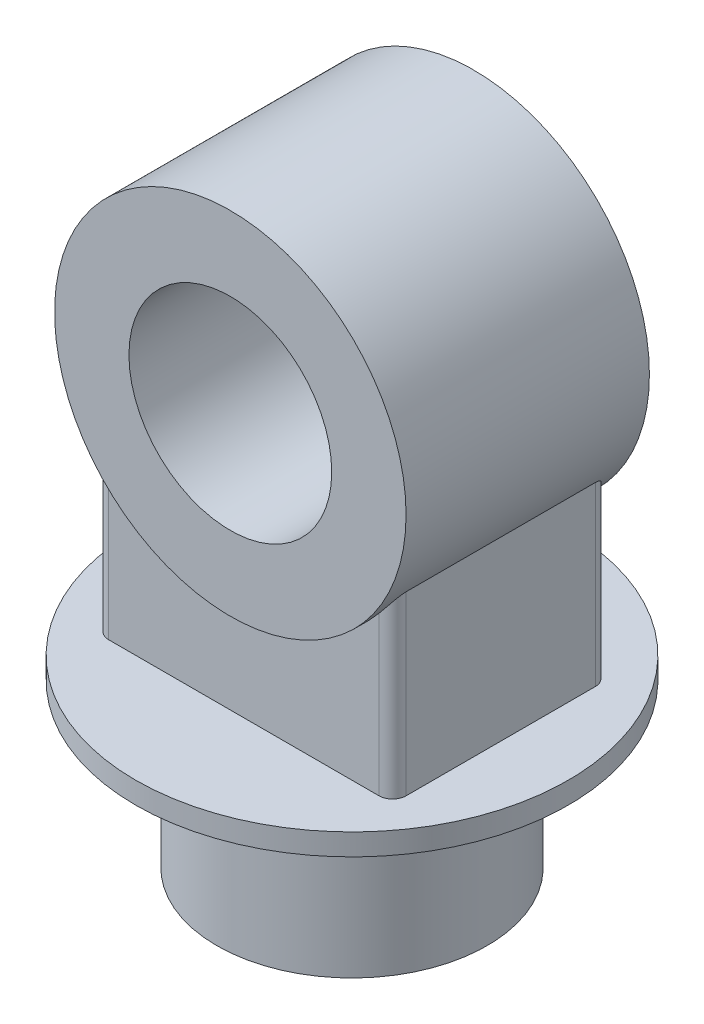
ISO-10303-21;
HEADER;
FILE_DESCRIPTION(('STEP AP214'),'2;1');
FILE_NAME('part.step','',(''),(''),'','','');
FILE_SCHEMA(('AUTOMOTIVE_DESIGN { 1 0 10303 214 1 1 1 1 }'));
ENDSEC;
DATA;
#1=APPLICATION_CONTEXT('core data for automotive mechanical design processes');
#2=APPLICATION_PROTOCOL_DEFINITION('international standard','automotive_design',2000,#1);
#3=PRODUCT_CONTEXT('',#1,'mechanical');
#4=PRODUCT('Part','Part','',(#3));
#5=PRODUCT_RELATED_PRODUCT_CATEGORY('part','',(#4));
#6=PRODUCT_DEFINITION_FORMATION('','',#4);
#7=PRODUCT_DEFINITION_CONTEXT('part definition',#1,'design');
#8=PRODUCT_DEFINITION('design','',#6,#7);
#9=PRODUCT_DEFINITION_SHAPE('','',#8);
#10=(LENGTH_UNIT() NAMED_UNIT(*) SI_UNIT(.MILLI.,.METRE.));
#11=(NAMED_UNIT(*) PLANE_ANGLE_UNIT() SI_UNIT($,.RADIAN.));
#12=(NAMED_UNIT(*) SI_UNIT($,.STERADIAN.) SOLID_ANGLE_UNIT());
#13=UNCERTAINTY_MEASURE_WITH_UNIT(LENGTH_MEASURE(1.E-05),#10,'distance_accuracy_value','');
#14=(GEOMETRIC_REPRESENTATION_CONTEXT(3) GLOBAL_UNCERTAINTY_ASSIGNED_CONTEXT((#13)) GLOBAL_UNIT_ASSIGNED_CONTEXT((#10,
#11,#12)) REPRESENTATION_CONTEXT('',''));
#15=CARTESIAN_POINT('',(0.,0.,0.));
#16=DIRECTION('',(0.,0.,1.));
#17=DIRECTION('',(1.,0.,0.));
#18=AXIS2_PLACEMENT_3D('',#15,#16,#17);
#19=CARTESIAN_POINT('',(0.,120.,0.));
#20=DIRECTION('',(0.,-1.,0.));
#21=DIRECTION('',(0.,0.,-1.));
#22=AXIS2_PLACEMENT_3D('',#19,#20,#21);
#23=CYLINDRICAL_SURFACE('',#22,100.);
#24=CARTESIAN_POINT('',(0.,120.,0.));
#25=DIRECTION('',(0.,1.,0.));
#26=DIRECTION('',(0.,0.,1.));
#27=AXIS2_PLACEMENT_3D('',#24,#25,#26);
#28=CIRCLE('',#27,100.);
#29=CARTESIAN_POINT('',(0.,120.,100.));
#30=VERTEX_POINT('',#29);
#31=EDGE_CURVE('E141',#30,#30,#28,.T.);
#32=ORIENTED_EDGE('',*,*,#31,.F.);
#33=EDGE_LOOP('',(#32));
#34=FACE_BOUND('',#33,.T.);
#35=CARTESIAN_POINT('',(0.,0.,0.));
#36=DIRECTION('',(0.,1.,0.));
#37=DIRECTION('',(0.,0.,1.));
#38=AXIS2_PLACEMENT_3D('',#35,#36,#37);
#39=CIRCLE('',#38,100.);
#40=CARTESIAN_POINT('',(0.,0.,100.));
#41=VERTEX_POINT('',#40);
#42=EDGE_CURVE('E218',#41,#41,#39,.T.);
#43=ORIENTED_EDGE('',*,*,#42,.T.);
#44=EDGE_LOOP('',(#43));
#45=FACE_BOUND('',#44,.T.);
#46=ADVANCED_FACE('F39',(#34,#45),#23,.T.);
#47=CARTESIAN_POINT('',(0.,0.,0.));
#48=DIRECTION('',(0.,1.,0.));
#49=DIRECTION('',(0.,0.,1.));
#50=AXIS2_PLACEMENT_3D('',#47,#48,#49);
#51=PLANE('',#50);
#52=ORIENTED_EDGE('',*,*,#42,.F.);
#53=EDGE_LOOP('',(#52));
#54=FACE_BOUND('',#53,.T.);
#55=ADVANCED_FACE('F206',(#54),#51,.F.);
#56=CARTESIAN_POINT('',(0.,136.,0.));
#57=DIRECTION('',(0.,-1.,0.));
#58=DIRECTION('',(0.,0.,-1.));
#59=AXIS2_PLACEMENT_3D('',#56,#57,#58);
#60=CYLINDRICAL_SURFACE('',#59,160.);
#61=CARTESIAN_POINT('',(0.,136.,0.));
#62=DIRECTION('',(0.,1.,0.));
#63=DIRECTION('',(0.,0.,1.));
#64=AXIS2_PLACEMENT_3D('',#61,#62,#63);
#65=CIRCLE('',#64,160.);
#66=CARTESIAN_POINT('',(0.,136.,160.));
#67=VERTEX_POINT('',#66);
#68=EDGE_CURVE('E219',#67,#67,#65,.T.);
#69=ORIENTED_EDGE('',*,*,#68,.F.);
#70=EDGE_LOOP('',(#69));
#71=FACE_BOUND('',#70,.T.);
#72=CARTESIAN_POINT('',(0.,120.,0.));
#73=DIRECTION('',(0.,1.,0.));
#74=DIRECTION('',(0.,0.,1.));
#75=AXIS2_PLACEMENT_3D('',#72,#73,#74);
#76=CIRCLE('',#75,160.);
#77=CARTESIAN_POINT('',(0.,120.,160.));
#78=VERTEX_POINT('',#77);
#79=EDGE_CURVE('E222',#78,#78,#76,.T.);
#80=ORIENTED_EDGE('',*,*,#79,.T.);
#81=EDGE_LOOP('',(#80));
#82=FACE_BOUND('',#81,.T.);
#83=ADVANCED_FACE('F211',(#71,#82),#60,.T.);
#84=CARTESIAN_POINT('',(0.,136.,0.));
#85=DIRECTION('',(0.,1.,0.));
#86=DIRECTION('',(0.,0.,1.));
#87=AXIS2_PLACEMENT_3D('',#84,#85,#86);
#88=PLANE('',#87);
#89=DIRECTION('',(0.,0.,-1.));
#90=VECTOR('',#89,1.);
#91=CARTESIAN_POINT('',(110.,136.,-80.));
#92=LINE('',#91,#90);
#93=CARTESIAN_POINT('',(110.,136.,70.));
#94=VERTEX_POINT('',#93);
#95=CARTESIAN_POINT('',(110.,136.,-70.));
#96=VERTEX_POINT('',#95);
#97=EDGE_CURVE('E226',#94,#96,#92,.T.);
#98=ORIENTED_EDGE('',*,*,#97,.F.);
#99=CARTESIAN_POINT('',(100.,136.,70.));
#100=DIRECTION('',(0.,1.,0.));
#101=DIRECTION('',(0.,0.,1.));
#102=AXIS2_PLACEMENT_3D('',#99,#100,#101);
#103=CIRCLE('',#102,10.);
#104=CARTESIAN_POINT('',(100.,136.,80.));
#105=VERTEX_POINT('',#104);
#106=EDGE_CURVE('E122',#94,#105,#103,.F.);
#107=ORIENTED_EDGE('',*,*,#106,.T.);
#108=DIRECTION('',(1.,0.,0.));
#109=VECTOR('',#108,1.);
#110=CARTESIAN_POINT('',(-110.,136.,80.));
#111=LINE('',#110,#109);
#112=CARTESIAN_POINT('',(-99.9999999999999,136.,80.));
#113=VERTEX_POINT('',#112);
#114=EDGE_CURVE('E231',#113,#105,#111,.T.);
#115=ORIENTED_EDGE('',*,*,#114,.F.);
#116=CARTESIAN_POINT('',(-99.9999999999999,136.,70.));
#117=DIRECTION('',(0.,1.,0.));
#118=DIRECTION('',(0.,0.,1.));
#119=AXIS2_PLACEMENT_3D('',#116,#117,#118);
#120=CIRCLE('',#119,10.);
#121=CARTESIAN_POINT('',(-110.,136.,70.));
#122=VERTEX_POINT('',#121);
#123=EDGE_CURVE('E53',#113,#122,#120,.F.);
#124=ORIENTED_EDGE('',*,*,#123,.T.);
#125=DIRECTION('',(0.,0.,1.));
#126=VECTOR('',#125,1.);
#127=CARTESIAN_POINT('',(-110.,136.,-80.));
#128=LINE('',#127,#126);
#129=CARTESIAN_POINT('',(-110.,136.,-70.));
#130=VERTEX_POINT('',#129);
#131=EDGE_CURVE('E234',#130,#122,#128,.T.);
#132=ORIENTED_EDGE('',*,*,#131,.F.);
#133=CARTESIAN_POINT('',(-100.,136.,-70.));
#134=DIRECTION('',(0.,1.,0.));
#135=DIRECTION('',(0.,0.,1.));
#136=AXIS2_PLACEMENT_3D('',#133,#134,#135);
#137=CIRCLE('',#136,10.);
#138=CARTESIAN_POINT('',(-100.,136.,-80.));
#139=VERTEX_POINT('',#138);
#140=EDGE_CURVE('E67',#130,#139,#137,.F.);
#141=ORIENTED_EDGE('',*,*,#140,.T.);
#142=DIRECTION('',(-1.,0.,0.));
#143=VECTOR('',#142,1.);
#144=CARTESIAN_POINT('',(-110.,136.,-80.));
#145=LINE('',#144,#143);
#146=CARTESIAN_POINT('',(100.,136.,-80.));
#147=VERTEX_POINT('',#146);
#148=EDGE_CURVE('E132',#147,#139,#145,.T.);
#149=ORIENTED_EDGE('',*,*,#148,.F.);
#150=CARTESIAN_POINT('',(100.,136.,-70.));
#151=DIRECTION('',(0.,1.,0.));
#152=DIRECTION('',(0.,0.,1.));
#153=AXIS2_PLACEMENT_3D('',#150,#151,#152);
#154=CIRCLE('',#153,10.);
#155=EDGE_CURVE('E121',#147,#96,#154,.F.);
#156=ORIENTED_EDGE('',*,*,#155,.T.);
#157=EDGE_LOOP('',(#98,#107,#115,#124,#132,#141,#149,#156));
#158=FACE_BOUND('',#157,.T.);
#159=ORIENTED_EDGE('',*,*,#68,.T.);
#160=EDGE_LOOP('',(#159));
#161=FACE_BOUND('',#160,.T.);
#162=ADVANCED_FACE('F348',(#158,#161),#88,.T.);
#163=CARTESIAN_POINT('',(0.,120.,0.));
#164=DIRECTION('',(0.,1.,0.));
#165=DIRECTION('',(0.,0.,1.));
#166=AXIS2_PLACEMENT_3D('',#163,#164,#165);
#167=PLANE('',#166);
#168=ORIENTED_EDGE('',*,*,#31,.T.);
#169=EDGE_LOOP('',(#168));
#170=FACE_BOUND('',#169,.T.);
#171=ORIENTED_EDGE('',*,*,#79,.F.);
#172=EDGE_LOOP('',(#171));
#173=FACE_BOUND('',#172,.T.);
#174=ADVANCED_FACE('F325',(#170,#173),#167,.F.);
#175=CARTESIAN_POINT('',(-110.,466.002,-80.));
#176=DIRECTION('',(0.,0.,1.));
#177=DIRECTION('',(1.,0.,0.));
#178=AXIS2_PLACEMENT_3D('',#175,#176,#177);
#179=PLANE('',#178);
#180=CARTESIAN_POINT('',(0.,336.,-80.));
#181=DIRECTION('',(0.,0.,1.));
#182=DIRECTION('',(1.,0.,0.));
#183=AXIS2_PLACEMENT_3D('',#180,#181,#182);
#184=CIRCLE('',#183,130.);
#185=CARTESIAN_POINT('',(100.,252.933761370819,-80.));
#186=VERTEX_POINT('',#185);
#187=CARTESIAN_POINT('',(-100.,252.933761370819,-80.));
#188=VERTEX_POINT('',#187);
#189=EDGE_CURVE('E133',#186,#188,#184,.F.);
#190=ORIENTED_EDGE('',*,*,#189,.F.);
#191=DIRECTION('',(0.,-1.,0.));
#192=VECTOR('',#191,1.);
#193=CARTESIAN_POINT('',(100.,466.002,-80.));
#194=LINE('',#193,#192);
#195=EDGE_CURVE('E148',#186,#147,#194,.T.);
#196=ORIENTED_EDGE('',*,*,#195,.T.);
#197=ORIENTED_EDGE('',*,*,#148,.T.);
#198=DIRECTION('',(0.,-1.,0.));
#199=VECTOR('',#198,1.);
#200=CARTESIAN_POINT('',(-100.,466.002,-80.));
#201=LINE('',#200,#199);
#202=EDGE_CURVE('E146',#139,#188,#201,.F.);
#203=ORIENTED_EDGE('',*,*,#202,.T.);
#204=EDGE_LOOP('',(#190,#196,#197,#203));
#205=FACE_BOUND('',#204,.T.);
#206=ADVANCED_FACE('F318',(#205),#179,.F.);
#207=CARTESIAN_POINT('',(110.,466.002,-80.));
#208=DIRECTION('',(-1.,0.,0.));
#209=DIRECTION('',(0.,0.,1.));
#210=AXIS2_PLACEMENT_3D('',#207,#208,#209);
#211=PLANE('',#210);
#212=DIRECTION('',(0.,0.,-1.));
#213=VECTOR('',#212,1.);
#214=CARTESIAN_POINT('',(110.,266.717967697245,90.));
#215=LINE('',#214,#213);
#216=CARTESIAN_POINT('',(110.,266.717967697245,70.0000000000001));
#217=VERTEX_POINT('',#216);
#218=CARTESIAN_POINT('',(110.,266.717967697245,-69.9999999999999));
#219=VERTEX_POINT('',#218);
#220=EDGE_CURVE('E114',#217,#219,#215,.T.);
#221=ORIENTED_EDGE('',*,*,#220,.F.);
#222=DIRECTION('',(0.,-1.,0.));
#223=VECTOR('',#222,1.);
#224=CARTESIAN_POINT('',(110.,466.002,70.));
#225=LINE('',#224,#223);
#226=EDGE_CURVE('E128',#217,#94,#225,.T.);
#227=ORIENTED_EDGE('',*,*,#226,.T.);
#228=ORIENTED_EDGE('',*,*,#97,.T.);
#229=DIRECTION('',(0.,-1.,0.));
#230=VECTOR('',#229,1.);
#231=CARTESIAN_POINT('',(110.,466.002,-70.));
#232=LINE('',#231,#230);
#233=EDGE_CURVE('E131',#96,#219,#232,.F.);
#234=ORIENTED_EDGE('',*,*,#233,.T.);
#235=EDGE_LOOP('',(#221,#227,#228,#234));
#236=FACE_BOUND('',#235,.T.);
#237=ADVANCED_FACE('F126',(#236),#211,.F.);
#238=CARTESIAN_POINT('',(-110.,466.002,-80.));
#239=DIRECTION('',(1.,0.,0.));
#240=DIRECTION('',(0.,0.,-1.));
#241=AXIS2_PLACEMENT_3D('',#238,#239,#240);
#242=PLANE('',#241);
#243=DIRECTION('',(0.,0.,-1.));
#244=VECTOR('',#243,1.);
#245=CARTESIAN_POINT('',(-110.,266.717967697245,90.));
#246=LINE('',#245,#244);
#247=CARTESIAN_POINT('',(-110.,266.717967697245,-69.9999999999999));
#248=VERTEX_POINT('',#247);
#249=CARTESIAN_POINT('',(-110.,266.717967697245,70.));
#250=VERTEX_POINT('',#249);
#251=EDGE_CURVE('E193',#248,#250,#246,.F.);
#252=ORIENTED_EDGE('',*,*,#251,.F.);
#253=DIRECTION('',(0.,-1.,0.));
#254=VECTOR('',#253,1.);
#255=CARTESIAN_POINT('',(-110.,466.002,-70.));
#256=LINE('',#255,#254);
#257=EDGE_CURVE('E153',#248,#130,#256,.T.);
#258=ORIENTED_EDGE('',*,*,#257,.T.);
#259=ORIENTED_EDGE('',*,*,#131,.T.);
#260=DIRECTION('',(0.,-1.,0.));
#261=VECTOR('',#260,1.);
#262=CARTESIAN_POINT('',(-110.,466.002,70.));
#263=LINE('',#262,#261);
#264=EDGE_CURVE('E151',#122,#250,#263,.F.);
#265=ORIENTED_EDGE('',*,*,#264,.T.);
#266=EDGE_LOOP('',(#252,#258,#259,#265));
#267=FACE_BOUND('',#266,.T.);
#268=ADVANCED_FACE('F197',(#267),#242,.F.);
#269=CARTESIAN_POINT('',(-110.,466.002,80.));
#270=DIRECTION('',(0.,0.,-1.));
#271=DIRECTION('',(-1.,0.,0.));
#272=AXIS2_PLACEMENT_3D('',#269,#270,#271);
#273=PLANE('',#272);
#274=ORIENTED_EDGE('',*,*,#114,.T.);
#275=DIRECTION('',(0.,-1.,0.));
#276=VECTOR('',#275,1.);
#277=CARTESIAN_POINT('',(100.,466.002,80.));
#278=LINE('',#277,#276);
#279=CARTESIAN_POINT('',(100.,252.933761370819,80.));
#280=VERTEX_POINT('',#279);
#281=EDGE_CURVE('E139',#105,#280,#278,.F.);
#282=ORIENTED_EDGE('',*,*,#281,.T.);
#283=CARTESIAN_POINT('',(0.,336.,80.));
#284=DIRECTION('',(0.,0.,-1.));
#285=DIRECTION('',(-1.,0.,0.));
#286=AXIS2_PLACEMENT_3D('',#283,#284,#285);
#287=CIRCLE('',#286,130.);
#288=CARTESIAN_POINT('',(-99.9999999999999,252.933761370819,80.));
#289=VERTEX_POINT('',#288);
#290=EDGE_CURVE('E117',#289,#280,#287,.F.);
#291=ORIENTED_EDGE('',*,*,#290,.F.);
#292=DIRECTION('',(0.,-1.,0.));
#293=VECTOR('',#292,1.);
#294=CARTESIAN_POINT('',(-99.9999999999999,466.002,80.));
#295=LINE('',#294,#293);
#296=EDGE_CURVE('E136',#289,#113,#295,.T.);
#297=ORIENTED_EDGE('',*,*,#296,.T.);
#298=EDGE_LOOP('',(#274,#282,#291,#297));
#299=FACE_BOUND('',#298,.T.);
#300=ADVANCED_FACE('F263',(#299),#273,.F.);
#301=CARTESIAN_POINT('',(0.,336.,90.));
#302=DIRECTION('',(0.,0.,-1.));
#303=DIRECTION('',(-1.,0.,0.));
#304=AXIS2_PLACEMENT_3D('',#301,#302,#303);
#305=CYLINDRICAL_SURFACE('',#304,130.);
#306=CARTESIAN_POINT('',(0.,336.,90.));
#307=DIRECTION('',(0.,0.,1.));
#308=DIRECTION('',(1.,0.,0.));
#309=AXIS2_PLACEMENT_3D('',#306,#307,#308);
#310=CIRCLE('',#309,130.);
#311=CARTESIAN_POINT('',(130.,336.,90.));
#312=VERTEX_POINT('',#311);
#313=EDGE_CURVE('E228',#312,#312,#310,.T.);
#314=ORIENTED_EDGE('',*,*,#313,.F.);
#315=EDGE_LOOP('',(#314));
#316=FACE_BOUND('',#315,.T.);
#317=CARTESIAN_POINT('',(0.,336.,-90.));
#318=DIRECTION('',(0.,0.,1.));
#319=DIRECTION('',(1.,0.,0.));
#320=AXIS2_PLACEMENT_3D('',#317,#318,#319);
#321=CIRCLE('',#320,130.);
#322=CARTESIAN_POINT('',(130.,336.,-90.));
#323=VERTEX_POINT('',#322);
#324=EDGE_CURVE('E239',#323,#323,#321,.T.);
#325=ORIENTED_EDGE('',*,*,#324,.T.);
#326=EDGE_LOOP('',(#325));
#327=FACE_BOUND('',#326,.T.);
#328=ORIENTED_EDGE('',*,*,#290,.T.);
#329=CARTESIAN_POINT('',(100.,252.933761370819,80.));
#330=CARTESIAN_POINT('',(100.223611151915,253.202952503255,79.9999830665315));
#331=CARTESIAN_POINT('',(100.446118360057,253.473036166024,79.9924995885085));
#332=CARTESIAN_POINT('',(100.888548742496,254.014496760122,79.9629173131463));
#333=CARTESIAN_POINT('',(101.10847204376,254.285873626978,79.9408192370116));
#334=CARTESIAN_POINT('',(101.545586290072,254.829711400373,79.8822979337704));
#335=CARTESIAN_POINT('',(101.76277446753,255.102173087004,79.8458612385232));
#336=CARTESIAN_POINT('',(102.193849033468,255.647413797012,79.7588609087488));
#337=CARTESIAN_POINT('',(102.407735374993,255.920192824843,79.7082970735218));
#338=CARTESIAN_POINT('',(103.048408055095,256.74400885936,79.5343891784367));
#339=CARTESIAN_POINT('',(103.469748368072,257.294974230618,79.3894263280958));
#340=CARTESIAN_POINT('',(104.088382224678,258.117224843771,79.1288060997198));
#341=CARTESIAN_POINT('',(104.292337034927,258.39057162742,79.0347525474725));
#342=CARTESIAN_POINT('',(104.695498702643,258.935304765081,78.8319429710982));
#343=CARTESIAN_POINT('',(104.894706004332,259.206691300842,78.7231883289499));
#344=CARTESIAN_POINT('',(105.336170271764,259.812965668139,78.4620472638273));
#345=CARTESIAN_POINT('',(105.577006541077,260.147108038148,78.3055009036513));
#346=CARTESIAN_POINT('',(106.049660949871,260.809343252621,77.967808626391));
#347=CARTESIAN_POINT('',(106.281479043935,261.137436066616,77.7866625854444));
#348=CARTESIAN_POINT('',(106.734152264033,261.784259610706,77.3986376161629));
#349=CARTESIAN_POINT('',(106.955036134368,262.103013877599,77.1918317878757));
#350=CARTESIAN_POINT('',(107.384708325122,262.728803605627,76.749894392022));
#351=CARTESIAN_POINT('',(107.593501627276,263.035843875289,76.5147746155493));
#352=CARTESIAN_POINT('',(107.921279015409,263.522080966667,76.1068757916446));
#353=CARTESIAN_POINT('',(108.044709884718,263.706240813683,75.9435605188263));
#354=CARTESIAN_POINT('',(108.284949666933,264.066582834907,75.6038296157538));
#355=CARTESIAN_POINT('',(108.401760304956,264.242767084987,75.4274174262629));
#356=CARTESIAN_POINT('',(108.627683741988,264.585236991633,75.0605773993747));
#357=CARTESIAN_POINT('',(108.736797961361,264.751524473746,74.8701521613913));
#358=CARTESIAN_POINT('',(108.945874410432,265.071634412635,74.4745306992528));
#359=CARTESIAN_POINT('',(109.04583974995,265.225461102935,74.2693395369045));
#360=CARTESIAN_POINT('',(109.274660386151,265.579056080623,73.7536743100227));
#361=CARTESIAN_POINT('',(109.398046362816,265.771031349643,73.4351396850743));
#362=CARTESIAN_POINT('',(109.561336457207,266.026263049993,72.9345418523036));
#363=CARTESIAN_POINT('',(109.612072269395,266.105785634321,72.7641622498837));
#364=CARTESIAN_POINT('',(109.705421847597,266.25239837099,72.4160328323223));
#365=CARTESIAN_POINT('',(109.748040656091,266.319496241142,72.2382876769633));
#366=CARTESIAN_POINT('',(109.820262744001,266.433384610412,71.8947331689277));
#367=CARTESIAN_POINT('',(109.850752312767,266.481551609067,71.7295676109391));
#368=CARTESIAN_POINT('',(109.903691363628,266.565274678988,71.3948451418077));
#369=CARTESIAN_POINT('',(109.926143541964,266.600834979285,71.2252897238034));
#370=CARTESIAN_POINT('',(109.962659042777,266.658707696818,70.8807814271978));
#371=CARTESIAN_POINT('',(109.976613864032,266.680848750137,70.7057875562758));
#372=CARTESIAN_POINT('',(109.99061964662,266.703076138542,70.4419386674803));
#373=CARTESIAN_POINT('',(109.99413386492,266.708654625172,70.3536902139711));
#374=CARTESIAN_POINT('',(109.998824989492,266.716102079046,70.1769662160103));
#375=CARTESIAN_POINT('',(110.000001659485,266.717970671296,70.0884906495071));
#376=CARTESIAN_POINT('',(110.,266.717967697245,70.0000000000001));
#377=B_SPLINE_CURVE_WITH_KNOTS('',3,(#329,#330,#331,#332,#333,#334,#335,#336,#337,#338,#339,
#340,#341,#342,#343,#344,#345,#346,#347,#348,#349,#350,#351,#352,#353,#354,#355,#356,#357,#358,
#359,#360,#361,#362,#363,#364,#365,#366,#367,#368,#369,#370,#371,#372,#373,#374,#375,#376),
.UNSPECIFIED.,.F.,.F.,(4,2,2,2,2,2,2,2,2,2,2,2,2,2,2,2,2,2,2,2,2,2,2,4),(0.,1.04974156507776,
2.09943133114572,3.1501094241727,4.2008024446203,6.32356278933853,7.38465211465328,
8.445641761345,9.76677685539398,11.087918601761,12.4053795382949,13.7222937149077,
14.5479419827464,15.3733741023699,16.1986534888326,17.023651302289,18.194686650492,
18.7783719827905,19.3616935243415,19.8852298594993,20.4085904030381,20.9385006934629,
21.2038887699912,21.4693036704869),.UNSPECIFIED.);
#378=EDGE_CURVE('E111',#280,#217,#377,.T.);
#379=ORIENTED_EDGE('',*,*,#378,.T.);
#380=ORIENTED_EDGE('',*,*,#220,.T.);
#381=CARTESIAN_POINT('',(110.,266.717967697245,-70.));
#382=CARTESIAN_POINT('',(110.000033683462,266.718025852698,-70.1614230595313));
#383=CARTESIAN_POINT('',(109.996092792414,266.711764254296,-70.322811819769));
#384=CARTESIAN_POINT('',(109.980519982779,266.687045880384,-70.6441123999957));
#385=CARTESIAN_POINT('',(109.968896213713,266.668602027069,-70.8040256031146));
#386=CARTESIAN_POINT('',(109.938376398954,266.620217986395,-71.119642455122));
#387=CARTESIAN_POINT('',(109.919558261622,266.590400967593,-71.2753727040436));
#388=CARTESIAN_POINT('',(109.875071558334,266.52000006118,-71.5834085562726));
#389=CARTESIAN_POINT('',(109.849400846184,266.479412800404,-71.7357130704249));
#390=CARTESIAN_POINT('',(109.784772267018,266.377386983169,-72.0722520040974));
#391=CARTESIAN_POINT('',(109.744103525393,266.313281105856,-72.2553511890568));
#392=CARTESIAN_POINT('',(109.654040532803,266.17165023193,-72.614146439185));
#393=CARTESIAN_POINT('',(109.604640075501,266.094115691273,-72.7898371277864));
#394=CARTESIAN_POINT('',(109.497968805892,265.927147418338,-73.133872391345));
#395=CARTESIAN_POINT('',(109.440667457039,265.837667562915,-73.302184951541));
#396=CARTESIAN_POINT('',(109.319341126161,265.648779195145,-73.6304969218558));
#397=CARTESIAN_POINT('',(109.25531768694,265.549372961282,-73.7904982269663));
#398=CARTESIAN_POINT('',(109.085069343255,265.28590129292,-74.1868876463209));
#399=CARTESIAN_POINT('',(108.974781990569,265.115997241409,-74.4176642111938));
#400=CARTESIAN_POINT('',(108.742772943656,264.76058359918,-74.8607110351426));
#401=CARTESIAN_POINT('',(108.621044869784,264.575065307649,-75.072970840064));
#402=CARTESIAN_POINT('',(108.36794946479,264.19164129378,-75.4804206329534));
#403=CARTESIAN_POINT('',(108.236568322626,263.993717884812,-75.6755852518652));
#404=CARTESIAN_POINT('',(107.965814499919,263.588382733388,-76.0497203250661));
#405=CARTESIAN_POINT('',(107.826442440892,263.380971729107,-76.22869203602));
#406=CARTESIAN_POINT('',(107.56145650763,262.989174407744,-76.5468161797371));
#407=CARTESIAN_POINT('',(107.436764821801,262.805791987749,-76.6879854690673));
#408=CARTESIAN_POINT('',(107.1828696798,262.434497987953,-76.9599552926783));
#409=CARTESIAN_POINT('',(107.053665586412,262.24658576965,-77.0907543539385));
#410=CARTESIAN_POINT('',(106.659844344167,261.677121003612,-77.4685356621901));
#411=CARTESIAN_POINT('',(106.389102445143,261.289965080353,-77.700802481696));
#412=CARTESIAN_POINT('',(105.833418194947,260.504836154638,-78.1298636316309));
#413=CARTESIAN_POINT('',(105.548442441802,260.106838810795,-78.3265689888295));
#414=CARTESIAN_POINT('',(104.96676628824,259.304344779382,-78.6860846955171));
#415=CARTESIAN_POINT('',(104.670068038633,258.899849292081,-78.8489012287857));
#416=CARTESIAN_POINT('',(104.024574509401,258.030646711215,-79.1623550419401));
#417=CARTESIAN_POINT('',(103.674248758637,257.565348460988,-79.3081944572228));
#418=CARTESIAN_POINT('',(102.961876677953,256.632523338709,-79.5587565200929));
#419=CARTESIAN_POINT('',(102.599828734006,256.16499616738,-79.6634734792563));
#420=CARTESIAN_POINT('',(102.051092736822,255.46639720469,-79.7891645729387));
#421=CARTESIAN_POINT('',(101.868137468165,255.235094848973,-79.8257282191264));
#422=CARTESIAN_POINT('',(101.499966150616,254.772885500361,-79.8886289353228));
#423=CARTESIAN_POINT('',(101.314750133026,254.541978502041,-79.9149661467554));
#424=CARTESIAN_POINT('',(100.942320486513,254.080919722901,-79.9572665465167));
#425=CARTESIAN_POINT('',(100.755107350153,253.850767773368,-79.9732322353467));
#426=CARTESIAN_POINT('',(100.378860262163,253.391449185777,-79.9945948234743));
#427=CARTESIAN_POINT('',(100.189826234412,253.162282589497,-79.9999912789887));
#428=CARTESIAN_POINT('',(100.,252.933761370819,-80.));
#429=B_SPLINE_CURVE_WITH_KNOTS('',3,(#381,#382,#383,#384,#385,#386,#387,#388,#389,#390,#391,
#392,#393,#394,#395,#396,#397,#398,#399,#400,#401,#402,#403,#404,#405,#406,#407,#408,#409,#410,
#411,#412,#413,#414,#415,#416,#417,#418,#419,#420,#421,#422,#423,#424,#425,#426,#427,#428),
.UNSPECIFIED.,.F.,.F.,(4,2,2,2,2,2,2,2,2,2,2,2,2,2,2,2,2,2,2,2,2,2,2,4),(0.,0.484045005923069,
0.967577389145412,1.44601544684508,1.92460352520313,2.51835043890468,3.11252108624074,
3.70905613988738,4.30545457926272,5.22516595363371,6.14539326092324,7.0669638228419,
7.98846280401958,8.7768009200053,9.56525081419884,11.1426900482286,12.7240229357797,
14.3050670200468,16.1047501551827,17.9046821508917,18.7960435003637,19.6873925225408,
20.5785265668947,21.4696980275819),.UNSPECIFIED.);
#430=EDGE_CURVE('E177',#219,#186,#429,.T.);
#431=ORIENTED_EDGE('',*,*,#430,.T.);
#432=ORIENTED_EDGE('',*,*,#189,.T.);
#433=CARTESIAN_POINT('',(-100.,252.933761370819,-80.));
#434=CARTESIAN_POINT('',(-100.223611151915,253.202952503255,-79.9999830665315));
#435=CARTESIAN_POINT('',(-100.446118360057,253.473036166024,-79.9924995885084));
#436=CARTESIAN_POINT('',(-100.888548742496,254.014496760122,-79.9629173131463));
#437=CARTESIAN_POINT('',(-101.108472043759,254.285873626978,-79.9408192370115));
#438=CARTESIAN_POINT('',(-101.545586290072,254.829711400373,-79.8822979337703));
#439=CARTESIAN_POINT('',(-101.76277446753,255.102173087004,-79.8458612385231));
#440=CARTESIAN_POINT('',(-102.193849033468,255.647413797012,-79.7588609087488));
#441=CARTESIAN_POINT('',(-102.407735374993,255.920192824843,-79.7082970735217));
#442=CARTESIAN_POINT('',(-103.048408055095,256.74400885936,-79.5343891784366));
#443=CARTESIAN_POINT('',(-103.469748368072,257.294974230618,-79.3894263280957));
#444=CARTESIAN_POINT('',(-104.088382224678,258.117224843771,-79.1288060997197));
#445=CARTESIAN_POINT('',(-104.292337034927,258.39057162742,-79.0347525474724));
#446=CARTESIAN_POINT('',(-104.695498702643,258.935304765081,-78.8319429710981));
#447=CARTESIAN_POINT('',(-104.894706004332,259.206691300842,-78.7231883289499));
#448=CARTESIAN_POINT('',(-105.336170271764,259.812965668139,-78.4620472638272));
#449=CARTESIAN_POINT('',(-105.577006541077,260.147108038148,-78.3055009036513));
#450=CARTESIAN_POINT('',(-106.04966094987,260.809343252621,-77.967808626391));
#451=CARTESIAN_POINT('',(-106.281479043935,261.137436066616,-77.7866625854443));
#452=CARTESIAN_POINT('',(-106.734152264033,261.784259610706,-77.3986376161628));
#453=CARTESIAN_POINT('',(-106.955036134368,262.103013877598,-77.1918317878757));
#454=CARTESIAN_POINT('',(-107.384708325122,262.728803605627,-76.749894392022));
#455=CARTESIAN_POINT('',(-107.593501627276,263.035843875289,-76.5147746155492));
#456=CARTESIAN_POINT('',(-107.921279015409,263.522080966666,-76.1068757916445));
#457=CARTESIAN_POINT('',(-108.044709884718,263.706240813682,-75.9435605188262));
#458=CARTESIAN_POINT('',(-108.284949666933,264.066582834907,-75.6038296157537));
#459=CARTESIAN_POINT('',(-108.401760304956,264.242767084986,-75.4274174262628));
#460=CARTESIAN_POINT('',(-108.627683741988,264.585236991633,-75.0605773993746));
#461=CARTESIAN_POINT('',(-108.736797961361,264.751524473746,-74.8701521613912));
#462=CARTESIAN_POINT('',(-108.945874410432,265.071634412635,-74.4745306992527));
#463=CARTESIAN_POINT('',(-109.04583974995,265.225461102935,-74.2693395369045));
#464=CARTESIAN_POINT('',(-109.274660386151,265.579056080623,-73.7536743100227));
#465=CARTESIAN_POINT('',(-109.398046362816,265.771031349643,-73.4351396850742));
#466=CARTESIAN_POINT('',(-109.561336457207,266.026263049992,-72.9345418523035));
#467=CARTESIAN_POINT('',(-109.612072269395,266.105785634321,-72.7641622498837));
#468=CARTESIAN_POINT('',(-109.705421847597,266.25239837099,-72.4160328323222));
#469=CARTESIAN_POINT('',(-109.748040656091,266.319496241142,-72.2382876769632));
#470=CARTESIAN_POINT('',(-109.820262744001,266.433384610412,-71.8947331689276));
#471=CARTESIAN_POINT('',(-109.850752312767,266.481551609067,-71.729567610939));
#472=CARTESIAN_POINT('',(-109.903691363628,266.565274678988,-71.3948451418076));
#473=CARTESIAN_POINT('',(-109.926143541964,266.600834979285,-71.2252897238033));
#474=CARTESIAN_POINT('',(-109.962659042777,266.658707696818,-70.8807814271977));
#475=CARTESIAN_POINT('',(-109.976613864032,266.680848750137,-70.7057875562757));
#476=CARTESIAN_POINT('',(-109.99061964662,266.703076138542,-70.4419386674803));
#477=CARTESIAN_POINT('',(-109.99413386492,266.708654625171,-70.3536902139711));
#478=CARTESIAN_POINT('',(-109.998824989492,266.716102079045,-70.1769662160102));
#479=CARTESIAN_POINT('',(-110.000001659485,266.717970671296,-70.088490649507));
#480=CARTESIAN_POINT('',(-110.,266.717967697245,-70.));
#481=B_SPLINE_CURVE_WITH_KNOTS('',3,(#433,#434,#435,#436,#437,#438,#439,#440,#441,#442,#443,
#444,#445,#446,#447,#448,#449,#450,#451,#452,#453,#454,#455,#456,#457,#458,#459,#460,#461,#462,
#463,#464,#465,#466,#467,#468,#469,#470,#471,#472,#473,#474,#475,#476,#477,#478,#479,#480),
.UNSPECIFIED.,.F.,.F.,(4,2,2,2,2,2,2,2,2,2,2,2,2,2,2,2,2,2,2,2,2,2,2,4),(0.,1.04974156507772,
2.09943133114568,3.15010942417266,4.20080244462032,6.32356278933856,7.38465211465323,
8.44564176134495,9.76677685539398,11.0879186017609,12.4053795382949,13.7222937149077,
14.5479419827464,15.3733741023698,16.1986534888326,17.0236513022889,18.1946866504919,
18.7783719827905,19.3616935243415,19.8852298594992,20.408590403038,20.9385006934629,
21.2038887699912,21.4693036704869),.UNSPECIFIED.);
#482=EDGE_CURVE('E184',#188,#248,#481,.T.);
#483=ORIENTED_EDGE('',*,*,#482,.T.);
#484=ORIENTED_EDGE('',*,*,#251,.T.);
#485=CARTESIAN_POINT('',(-110.,266.717967697245,70.));
#486=CARTESIAN_POINT('',(-110.000033683462,266.718025852698,70.1614230595313));
#487=CARTESIAN_POINT('',(-109.996092792414,266.711764254296,70.3228118197691));
#488=CARTESIAN_POINT('',(-109.980519982779,266.687045880384,70.6441123999958));
#489=CARTESIAN_POINT('',(-109.968896213713,266.668602027069,70.8040256031146));
#490=CARTESIAN_POINT('',(-109.938376398954,266.620217986395,71.1196424551221));
#491=CARTESIAN_POINT('',(-109.919558261622,266.590400967593,71.2753727040436));
#492=CARTESIAN_POINT('',(-109.875071558334,266.52000006118,71.5834085562727));
#493=CARTESIAN_POINT('',(-109.849400846184,266.479412800404,71.735713070425));
#494=CARTESIAN_POINT('',(-109.784772267017,266.377386983169,72.0722520040975));
#495=CARTESIAN_POINT('',(-109.744103525393,266.313281105855,72.2553511890568));
#496=CARTESIAN_POINT('',(-109.654040532803,266.171650231929,72.6141464391851));
#497=CARTESIAN_POINT('',(-109.604640075501,266.094115691273,72.7898371277865));
#498=CARTESIAN_POINT('',(-109.497968805892,265.927147418338,73.1338723913451));
#499=CARTESIAN_POINT('',(-109.440667457039,265.837667562915,73.3021849515411));
#500=CARTESIAN_POINT('',(-109.319341126161,265.648779195145,73.6304969218559));
#501=CARTESIAN_POINT('',(-109.25531768694,265.549372961282,73.7904982269664));
#502=CARTESIAN_POINT('',(-109.085069343255,265.285901292919,74.1868876463209));
#503=CARTESIAN_POINT('',(-108.974781990569,265.115997241409,74.4176642111939));
#504=CARTESIAN_POINT('',(-108.742772943656,264.76058359918,74.8607110351426));
#505=CARTESIAN_POINT('',(-108.621044869784,264.575065307649,75.072970840064));
#506=CARTESIAN_POINT('',(-108.36794946479,264.19164129378,75.4804206329535));
#507=CARTESIAN_POINT('',(-108.236568322626,263.993717884812,75.6755852518652));
#508=CARTESIAN_POINT('',(-107.965814499919,263.588382733387,76.0497203250662));
#509=CARTESIAN_POINT('',(-107.826442440892,263.380971729107,76.2286920360201));
#510=CARTESIAN_POINT('',(-107.56145650763,262.989174407744,76.5468161797372));
#511=CARTESIAN_POINT('',(-107.436764821801,262.805791987749,76.6879854690674));
#512=CARTESIAN_POINT('',(-107.182869679799,262.434497987953,76.9599552926783));
#513=CARTESIAN_POINT('',(-107.053665586411,262.24658576965,77.0907543539386));
#514=CARTESIAN_POINT('',(-106.659844344167,261.677121003612,77.4685356621902));
#515=CARTESIAN_POINT('',(-106.389102445143,261.289965080353,77.7008024816961));
#516=CARTESIAN_POINT('',(-105.833418194947,260.504836154638,78.129863631631));
#517=CARTESIAN_POINT('',(-105.548442441802,260.106838810795,78.3265689888296));
#518=CARTESIAN_POINT('',(-104.96676628824,259.304344779382,78.6860846955171));
#519=CARTESIAN_POINT('',(-104.670068038633,258.899849292081,78.8489012287858));
#520=CARTESIAN_POINT('',(-104.024574509401,258.030646711215,79.1623550419402));
#521=CARTESIAN_POINT('',(-103.674248758637,257.565348460988,79.3081944572228));
#522=CARTESIAN_POINT('',(-102.961876677953,256.632523338709,79.558756520093));
#523=CARTESIAN_POINT('',(-102.599828734006,256.16499616738,79.6634734792563));
#524=CARTESIAN_POINT('',(-102.051092736822,255.466397204689,79.7891645729388));
#525=CARTESIAN_POINT('',(-101.868137468165,255.235094848973,79.8257282191265));
#526=CARTESIAN_POINT('',(-101.499966150616,254.77288550036,79.8886289353229));
#527=CARTESIAN_POINT('',(-101.314750133026,254.541978502041,79.9149661467555));
#528=CARTESIAN_POINT('',(-100.942320486513,254.080919722901,79.9572665465168));
#529=CARTESIAN_POINT('',(-100.755107350153,253.850767773367,79.9732322353467));
#530=CARTESIAN_POINT('',(-100.378860262163,253.391449185777,79.9945948234744));
#531=CARTESIAN_POINT('',(-100.189826234412,253.162282589497,79.9999912789888));
#532=CARTESIAN_POINT('',(-99.9999999999999,252.933761370819,80.));
#533=B_SPLINE_CURVE_WITH_KNOTS('',3,(#485,#486,#487,#488,#489,#490,#491,#492,#493,#494,#495,
#496,#497,#498,#499,#500,#501,#502,#503,#504,#505,#506,#507,#508,#509,#510,#511,#512,#513,#514,
#515,#516,#517,#518,#519,#520,#521,#522,#523,#524,#525,#526,#527,#528,#529,#530,#531,#532),
.UNSPECIFIED.,.F.,.F.,(4,2,2,2,2,2,2,2,2,2,2,2,2,2,2,2,2,2,2,2,2,2,2,4),(0.,0.484045005923072,
0.967577389145422,1.44601544684508,1.92460352520315,2.51835043890469,3.11252108624078,
3.70905613988743,4.30545457926273,5.22516595363372,6.14539326092322,7.06696382284189,
7.98846280401961,8.77680092000539,9.56525081419895,11.1426900482285,12.7240229357797,
14.3050670200469,16.1047501551827,17.9046821508917,18.7960435003636,19.6873925225408,
20.5785265668947,21.4696980275818),.UNSPECIFIED.);
#534=EDGE_CURVE('E11',#250,#289,#533,.T.);
#535=ORIENTED_EDGE('',*,*,#534,.T.);
#536=EDGE_LOOP('',(#328,#379,#380,#431,#432,#483,#484,#535));
#537=FACE_BOUND('',#536,.T.);
#538=ADVANCED_FACE('F113',(#316,#327,#537),#305,.T.);
#539=CARTESIAN_POINT('',(0.,336.,90.));
#540=DIRECTION('',(0.,0.,1.));
#541=DIRECTION('',(1.,0.,0.));
#542=AXIS2_PLACEMENT_3D('',#539,#540,#541);
#543=PLANE('',#542);
#544=ORIENTED_EDGE('',*,*,#313,.T.);
#545=EDGE_LOOP('',(#544));
#546=FACE_BOUND('',#545,.T.);
#547=CARTESIAN_POINT('',(0.,336.,90.));
#548=DIRECTION('',(0.,0.,1.));
#549=DIRECTION('',(1.,0.,0.));
#550=AXIS2_PLACEMENT_3D('',#547,#548,#549);
#551=CIRCLE('',#550,75.);
#552=CARTESIAN_POINT('',(-75.,336.,90.));
#553=VERTEX_POINT('',#552);
#554=EDGE_CURVE('E242',#553,#553,#551,.T.);
#555=ORIENTED_EDGE('',*,*,#554,.F.);
#556=EDGE_LOOP('',(#555));
#557=FACE_BOUND('',#556,.T.);
#558=ADVANCED_FACE('F253',(#546,#557),#543,.T.);
#559=CARTESIAN_POINT('',(0.,336.,-90.));
#560=DIRECTION('',(0.,0.,1.));
#561=DIRECTION('',(1.,0.,0.));
#562=AXIS2_PLACEMENT_3D('',#559,#560,#561);
#563=PLANE('',#562);
#564=ORIENTED_EDGE('',*,*,#324,.F.);
#565=EDGE_LOOP('',(#564));
#566=FACE_BOUND('',#565,.T.);
#567=CARTESIAN_POINT('',(0.,336.,-90.));
#568=DIRECTION('',(0.,0.,1.));
#569=DIRECTION('',(1.,0.,0.));
#570=AXIS2_PLACEMENT_3D('',#567,#568,#569);
#571=CIRCLE('',#570,75.);
#572=CARTESIAN_POINT('',(-75.,336.,-90.));
#573=VERTEX_POINT('',#572);
#574=EDGE_CURVE('E245',#573,#573,#571,.T.);
#575=ORIENTED_EDGE('',*,*,#574,.T.);
#576=EDGE_LOOP('',(#575));
#577=FACE_BOUND('',#576,.T.);
#578=ADVANCED_FACE('F255',(#566,#577),#563,.F.);
#579=CARTESIAN_POINT('',(0.,336.,90.));
#580=DIRECTION('',(0.,0.,-1.));
#581=DIRECTION('',(-1.,0.,0.));
#582=AXIS2_PLACEMENT_3D('',#579,#580,#581);
#583=CYLINDRICAL_SURFACE('',#582,75.);
#584=CARTESIAN_POINT('',(-75.,336.,90.));
#585=CARTESIAN_POINT('',(-75.,336.,88.125));
#586=CARTESIAN_POINT('',(-75.,336.,86.25));
#587=CARTESIAN_POINT('',(-75.,336.,82.5));
#588=CARTESIAN_POINT('',(-75.,336.,80.625));
#589=CARTESIAN_POINT('',(-75.,336.,76.875));
#590=CARTESIAN_POINT('',(-75.,336.,75.));
#591=CARTESIAN_POINT('',(-75.,336.,71.25));
#592=CARTESIAN_POINT('',(-75.,336.,69.375));
#593=CARTESIAN_POINT('',(-75.,336.,65.625));
#594=CARTESIAN_POINT('',(-75.,336.,63.75));
#595=CARTESIAN_POINT('',(-75.,336.,60.));
#596=CARTESIAN_POINT('',(-75.,336.,58.125));
#597=CARTESIAN_POINT('',(-75.,336.,54.375));
#598=CARTESIAN_POINT('',(-75.,336.,52.5));
#599=CARTESIAN_POINT('',(-75.,336.,48.75));
#600=CARTESIAN_POINT('',(-75.,336.,46.875));
#601=CARTESIAN_POINT('',(-75.,336.,43.125));
#602=CARTESIAN_POINT('',(-75.,336.,41.25));
#603=CARTESIAN_POINT('',(-75.,336.,37.5));
#604=CARTESIAN_POINT('',(-75.,336.,35.625));
#605=CARTESIAN_POINT('',(-75.,336.,31.875));
#606=CARTESIAN_POINT('',(-75.,336.,30.));
#607=CARTESIAN_POINT('',(-75.,336.,26.25));
#608=CARTESIAN_POINT('',(-75.,336.,24.375));
#609=CARTESIAN_POINT('',(-75.,336.,20.625));
#610=CARTESIAN_POINT('',(-75.,336.,18.75));
#611=CARTESIAN_POINT('',(-75.,336.,15.));
#612=CARTESIAN_POINT('',(-75.,336.,13.125));
#613=CARTESIAN_POINT('',(-75.,336.,9.37499999999998));
#614=CARTESIAN_POINT('',(-75.,336.,7.49999999999998));
#615=CARTESIAN_POINT('',(-75.,336.,3.74999999999998));
#616=CARTESIAN_POINT('',(-75.,336.,1.87499999999997));
#617=CARTESIAN_POINT('',(-75.,336.,-1.87500000000003));
#618=CARTESIAN_POINT('',(-75.,336.,-3.75000000000003));
#619=CARTESIAN_POINT('',(-75.,336.,-7.50000000000003));
#620=CARTESIAN_POINT('',(-75.,336.,-9.37500000000004));
#621=CARTESIAN_POINT('',(-75.,336.,-13.125));
#622=CARTESIAN_POINT('',(-75.,336.,-15.));
#623=CARTESIAN_POINT('',(-75.,336.,-18.75));
#624=CARTESIAN_POINT('',(-75.,336.,-20.625));
#625=CARTESIAN_POINT('',(-75.,336.,-24.375));
#626=CARTESIAN_POINT('',(-75.,336.,-26.25));
#627=CARTESIAN_POINT('',(-75.,336.,-30.));
#628=CARTESIAN_POINT('',(-75.,336.,-31.875));
#629=CARTESIAN_POINT('',(-75.,336.,-35.625));
#630=CARTESIAN_POINT('',(-75.,336.,-37.5));
#631=CARTESIAN_POINT('',(-75.,336.,-41.25));
#632=CARTESIAN_POINT('',(-75.,336.,-43.125));
#633=CARTESIAN_POINT('',(-75.,336.,-46.875));
#634=CARTESIAN_POINT('',(-75.,336.,-48.75));
#635=CARTESIAN_POINT('',(-75.,336.,-52.5));
#636=CARTESIAN_POINT('',(-75.,336.,-54.375));
#637=CARTESIAN_POINT('',(-75.,336.,-58.125));
#638=CARTESIAN_POINT('',(-75.,336.,-60.));
#639=CARTESIAN_POINT('',(-75.,336.,-63.75));
#640=CARTESIAN_POINT('',(-75.,336.,-65.625));
#641=CARTESIAN_POINT('',(-75.,336.,-69.375));
#642=CARTESIAN_POINT('',(-75.,336.,-71.25));
#643=CARTESIAN_POINT('',(-75.,336.,-75.));
#644=CARTESIAN_POINT('',(-75.,336.,-76.875));
#645=CARTESIAN_POINT('',(-75.,336.,-80.625));
#646=CARTESIAN_POINT('',(-75.,336.,-82.5));
#647=CARTESIAN_POINT('',(-75.,336.,-86.25));
#648=CARTESIAN_POINT('',(-75.,336.,-88.125));
#649=CARTESIAN_POINT('',(-75.,336.,-90.));
#650=B_SPLINE_CURVE_WITH_KNOTS('',3,(#584,#585,#586,#587,#588,#589,#590,#591,#592,#593,#594,
#595,#596,#597,#598,#599,#600,#601,#602,#603,#604,#605,#606,#607,#608,#609,#610,#611,#612,#613,
#614,#615,#616,#617,#618,#619,#620,#621,#622,#623,#624,#625,#626,#627,#628,#629,#630,#631,#632,
#633,#634,#635,#636,#637,#638,#639,#640,#641,#642,#643,#644,#645,#646,#647,#648,#649),
.UNSPECIFIED.,.F.,.F.,(4,2,2,2,2,2,2,2,2,2,2,2,2,2,2,2,2,2,2,2,2,2,2,2,2,2,2,2,2,2,2,2,4),(0.,
5.62499999999999,11.25,16.875,22.5,28.125,33.75,39.375,45.,50.625,56.25,61.875,67.5,73.125,
78.75,84.375,90.,95.625,101.25,106.875,112.5,118.125,123.75,129.375,135.,140.625,146.25,151.875,
157.5,163.125,168.75,174.375,180.),.UNSPECIFIED.);
#651=EDGE_CURVE('BSEAM170',#553,#573,#650,.T.);
#652=ORIENTED_EDGE('',*,*,#554,.T.);
#653=ORIENTED_EDGE('',*,*,#574,.F.);
#654=ORIENTED_EDGE('',*,*,#651,.T.);
#655=ORIENTED_EDGE('',*,*,#651,.F.);
#656=EDGE_LOOP('',(#652,#654,#653,#655));
#657=FACE_BOUND('',#656,.T.);
#658=ADVANCED_FACE('F170',(#657),#583,.F.);
#659=CARTESIAN_POINT('',(100.,466.002,70.));
#660=DIRECTION('',(0.,-1.,0.));
#661=DIRECTION('',(0.,0.,-1.));
#662=AXIS2_PLACEMENT_3D('',#659,#660,#661);
#663=CYLINDRICAL_SURFACE('',#662,10.);
#664=ORIENTED_EDGE('',*,*,#378,.F.);
#665=ORIENTED_EDGE('',*,*,#281,.F.);
#666=ORIENTED_EDGE('',*,*,#106,.F.);
#667=ORIENTED_EDGE('',*,*,#226,.F.);
#668=EDGE_LOOP('',(#664,#665,#666,#667));
#669=FACE_BOUND('',#668,.T.);
#670=ADVANCED_FACE('F135',(#669),#663,.T.);
#671=CARTESIAN_POINT('',(100.,466.002,-70.));
#672=DIRECTION('',(0.,-1.,0.));
#673=DIRECTION('',(0.,0.,-1.));
#674=AXIS2_PLACEMENT_3D('',#671,#672,#673);
#675=CYLINDRICAL_SURFACE('',#674,10.);
#676=ORIENTED_EDGE('',*,*,#430,.F.);
#677=ORIENTED_EDGE('',*,*,#233,.F.);
#678=ORIENTED_EDGE('',*,*,#155,.F.);
#679=ORIENTED_EDGE('',*,*,#195,.F.);
#680=EDGE_LOOP('',(#676,#677,#678,#679));
#681=FACE_BOUND('',#680,.T.);
#682=ADVANCED_FACE('F169',(#681),#675,.T.);
#683=CARTESIAN_POINT('',(-100.,466.002,-70.));
#684=DIRECTION('',(0.,-1.,0.));
#685=DIRECTION('',(0.,0.,-1.));
#686=AXIS2_PLACEMENT_3D('',#683,#684,#685);
#687=CYLINDRICAL_SURFACE('',#686,10.);
#688=ORIENTED_EDGE('',*,*,#482,.F.);
#689=ORIENTED_EDGE('',*,*,#202,.F.);
#690=ORIENTED_EDGE('',*,*,#140,.F.);
#691=ORIENTED_EDGE('',*,*,#257,.F.);
#692=EDGE_LOOP('',(#688,#689,#690,#691));
#693=FACE_BOUND('',#692,.T.);
#694=ADVANCED_FACE('F174',(#693),#687,.T.);
#695=CARTESIAN_POINT('',(-99.9999999999999,466.002,70.));
#696=DIRECTION('',(0.,-1.,0.));
#697=DIRECTION('',(0.,0.,-1.));
#698=AXIS2_PLACEMENT_3D('',#695,#696,#697);
#699=CYLINDRICAL_SURFACE('',#698,10.);
#700=ORIENTED_EDGE('',*,*,#534,.F.);
#701=ORIENTED_EDGE('',*,*,#264,.F.);
#702=ORIENTED_EDGE('',*,*,#123,.F.);
#703=ORIENTED_EDGE('',*,*,#296,.F.);
#704=EDGE_LOOP('',(#700,#701,#702,#703));
#705=FACE_BOUND('',#704,.T.);
#706=ADVANCED_FACE('F41',(#705),#699,.T.);
#707=CLOSED_SHELL('',(#46,#55,#83,#162,#174,#206,#237,#268,#300,#538,#558,#578,#658,#670,#682,
#694,#706));
#708=MANIFOLD_SOLID_BREP('B2',#707);
#709=ADVANCED_BREP_SHAPE_REPRESENTATION('',(#18,#708),#14);
#710=SHAPE_DEFINITION_REPRESENTATION(#9,#709);
ENDSEC;
END-ISO-10303-21;
